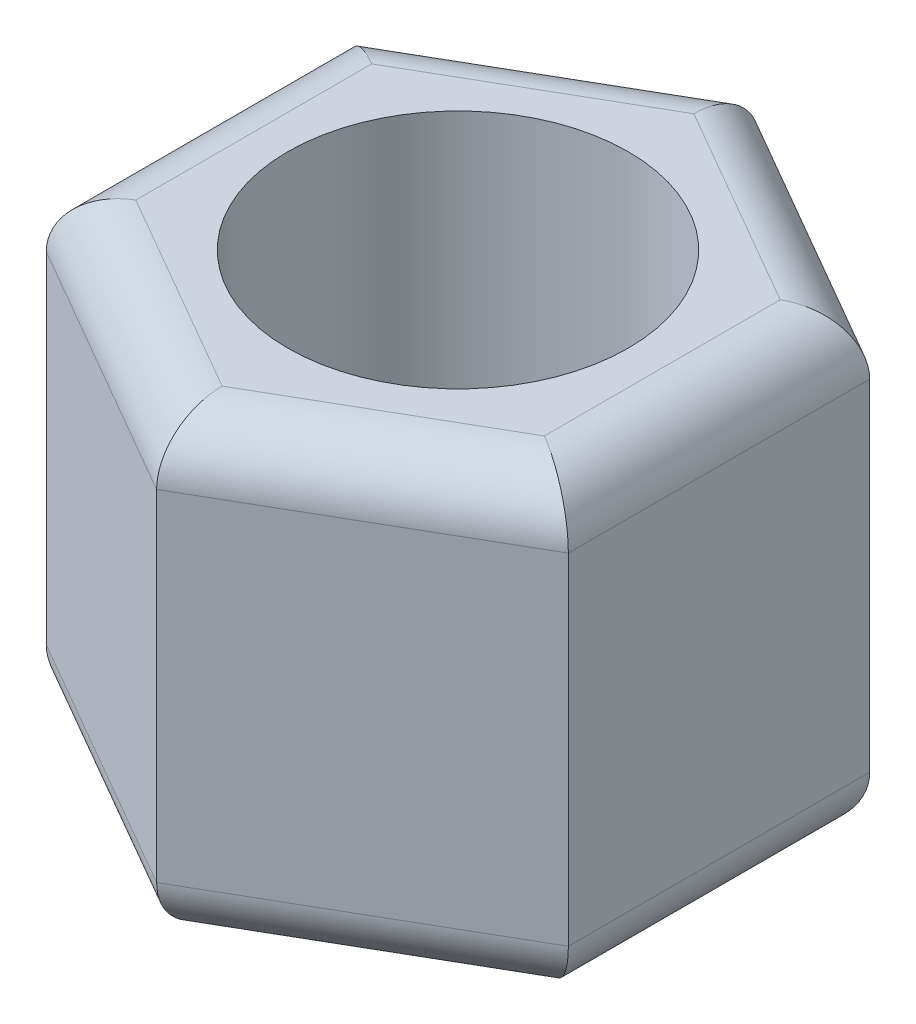
ISO-10303-21;
HEADER;
FILE_DESCRIPTION(('STEP AP214'),'2;1');
FILE_NAME('part.step','',(''),(''),'','','');
FILE_SCHEMA(('AUTOMOTIVE_DESIGN { 1 0 10303 214 1 1 1 1 }'));
ENDSEC;
DATA;
#1=APPLICATION_CONTEXT('core data for automotive mechanical design processes');
#2=APPLICATION_PROTOCOL_DEFINITION('international standard','automotive_design',2000,#1);
#3=PRODUCT_CONTEXT('',#1,'mechanical');
#4=PRODUCT('Part','Part','',(#3));
#5=PRODUCT_RELATED_PRODUCT_CATEGORY('part','',(#4));
#6=PRODUCT_DEFINITION_FORMATION('','',#4);
#7=PRODUCT_DEFINITION_CONTEXT('part definition',#1,'design');
#8=PRODUCT_DEFINITION('design','',#6,#7);
#9=PRODUCT_DEFINITION_SHAPE('','',#8);
#10=(LENGTH_UNIT() NAMED_UNIT(*) SI_UNIT(.MILLI.,.METRE.));
#11=(NAMED_UNIT(*) PLANE_ANGLE_UNIT() SI_UNIT($,.RADIAN.));
#12=(NAMED_UNIT(*) SI_UNIT($,.STERADIAN.) SOLID_ANGLE_UNIT());
#13=UNCERTAINTY_MEASURE_WITH_UNIT(LENGTH_MEASURE(1.E-05),#10,'distance_accuracy_value','');
#14=(GEOMETRIC_REPRESENTATION_CONTEXT(3) GLOBAL_UNCERTAINTY_ASSIGNED_CONTEXT((#13)) GLOBAL_UNIT_ASSIGNED_CONTEXT((#10,
#11,#12)) REPRESENTATION_CONTEXT('',''));
#15=CARTESIAN_POINT('',(0.,0.,0.));
#16=DIRECTION('',(0.,0.,1.));
#17=DIRECTION('',(1.,0.,0.));
#18=AXIS2_PLACEMENT_3D('',#15,#16,#17);
#19=CARTESIAN_POINT('',(0.,4.,0.));
#20=DIRECTION('',(0.,1.,0.));
#21=DIRECTION('',(0.,0.,1.));
#22=AXIS2_PLACEMENT_3D('',#19,#20,#21);
#23=PLANE('',#22);
#24=DIRECTION('',(0.,0.,1.));
#25=VECTOR('',#24,1.);
#26=CARTESIAN_POINT('',(-1.8,4.,1.32790561913614));
#27=LINE('',#26,#25);
#28=CARTESIAN_POINT('',(-1.8,4.,-1.03923048454133));
#29=VERTEX_POINT('',#28);
#30=CARTESIAN_POINT('',(-1.8,4.,1.03923048454133));
#31=VERTEX_POINT('',#30);
#32=EDGE_CURVE('E44',#29,#31,#27,.T.);
#33=ORIENTED_EDGE('',*,*,#32,.T.);
#34=DIRECTION('',(0.866025403784438,0.,0.5));
#35=VECTOR('',#34,1.);
#36=CARTESIAN_POINT('',(0.249999999999999,4.,2.22279853638006));
#37=LINE('',#36,#35);
#38=CARTESIAN_POINT('',(0.,4.,2.07846096908265));
#39=VERTEX_POINT('',#38);
#40=EDGE_CURVE('E11',#31,#39,#37,.T.);
#41=ORIENTED_EDGE('',*,*,#40,.T.);
#42=DIRECTION('',(0.866025403784439,0.,-0.5));
#43=VECTOR('',#42,1.);
#44=CARTESIAN_POINT('',(2.05,4.,0.894892917243921));
#45=LINE('',#44,#43);
#46=CARTESIAN_POINT('',(1.8,4.,1.03923048454133));
#47=VERTEX_POINT('',#46);
#48=EDGE_CURVE('E160',#39,#47,#45,.T.);
#49=ORIENTED_EDGE('',*,*,#48,.T.);
#50=DIRECTION('',(0.,0.,-1.));
#51=VECTOR('',#50,1.);
#52=CARTESIAN_POINT('',(1.8,4.,-1.32790561913614));
#53=LINE('',#52,#51);
#54=CARTESIAN_POINT('',(1.8,4.,-1.03923048454133));
#55=VERTEX_POINT('',#54);
#56=EDGE_CURVE('E257',#47,#55,#53,.T.);
#57=ORIENTED_EDGE('',*,*,#56,.T.);
#58=DIRECTION('',(-0.866025403784439,0.,-0.5));
#59=VECTOR('',#58,1.);
#60=CARTESIAN_POINT('',(-0.25,4.,-2.22279853638006));
#61=LINE('',#60,#59);
#62=CARTESIAN_POINT('',(0.,4.,-2.07846096908265));
#63=VERTEX_POINT('',#62);
#64=EDGE_CURVE('E259',#55,#63,#61,.T.);
#65=ORIENTED_EDGE('',*,*,#64,.T.);
#66=DIRECTION('',(-0.866025403784439,0.,0.5));
#67=VECTOR('',#66,1.);
#68=CARTESIAN_POINT('',(-2.05,4.,-0.894892917243921));
#69=LINE('',#68,#67);
#70=EDGE_CURVE('E55',#63,#29,#69,.T.);
#71=ORIENTED_EDGE('',*,*,#70,.T.);
#72=EDGE_LOOP('',(#33,#41,#49,#57,#65,#71));
#73=FACE_BOUND('',#72,.T.);
#74=CARTESIAN_POINT('',(0.,4.,0.));
#75=DIRECTION('',(0.,1.,0.));
#76=DIRECTION('',(0.,0.,1.));
#77=AXIS2_PLACEMENT_3D('',#74,#75,#76);
#78=CIRCLE('',#77,1.5);
#79=CARTESIAN_POINT('',(0.,4.,1.5));
#80=VERTEX_POINT('',#79);
#81=EDGE_CURVE('E149',#80,#80,#78,.T.);
#82=ORIENTED_EDGE('',*,*,#81,.F.);
#83=EDGE_LOOP('',(#82));
#84=FACE_BOUND('',#83,.T.);
#85=ADVANCED_FACE('F35',(#73,#84),#23,.T.);
#86=CARTESIAN_POINT('',(0.,0.,0.));
#87=DIRECTION('',(0.,1.,0.));
#88=DIRECTION('',(0.,0.,1.));
#89=AXIS2_PLACEMENT_3D('',#86,#87,#88);
#90=PLANE('',#89);
#91=DIRECTION('',(0.866025403784439,0.,-0.5));
#92=VECTOR('',#91,1.);
#93=CARTESIAN_POINT('',(0.899999999999999,0.,1.55884572681199));
#94=LINE('',#93,#92);
#95=CARTESIAN_POINT('',(1.8,0.,1.03923048454133));
#96=VERTEX_POINT('',#95);
#97=CARTESIAN_POINT('',(0.,0.,2.07846096908265));
#98=VERTEX_POINT('',#97);
#99=EDGE_CURVE('E235',#96,#98,#94,.F.);
#100=ORIENTED_EDGE('',*,*,#99,.T.);
#101=DIRECTION('',(0.866025403784438,0.,0.5));
#102=VECTOR('',#101,1.);
#103=CARTESIAN_POINT('',(-0.9,0.,1.55884572681199));
#104=LINE('',#103,#102);
#105=CARTESIAN_POINT('',(-1.8,0.,1.03923048454133));
#106=VERTEX_POINT('',#105);
#107=EDGE_CURVE('E136',#98,#106,#104,.F.);
#108=ORIENTED_EDGE('',*,*,#107,.T.);
#109=DIRECTION('',(0.,0.,1.));
#110=VECTOR('',#109,1.);
#111=CARTESIAN_POINT('',(-1.8,0.,0.));
#112=LINE('',#111,#110);
#113=CARTESIAN_POINT('',(-1.8,0.,-1.03923048454133));
#114=VERTEX_POINT('',#113);
#115=EDGE_CURVE('E227',#106,#114,#112,.F.);
#116=ORIENTED_EDGE('',*,*,#115,.T.);
#117=DIRECTION('',(-0.866025403784439,0.,0.5));
#118=VECTOR('',#117,1.);
#119=CARTESIAN_POINT('',(-0.9,0.,-1.55884572681199));
#120=LINE('',#119,#118);
#121=CARTESIAN_POINT('',(0.,0.,-2.07846096908265));
#122=VERTEX_POINT('',#121);
#123=EDGE_CURVE('E229',#114,#122,#120,.F.);
#124=ORIENTED_EDGE('',*,*,#123,.T.);
#125=DIRECTION('',(-0.866025403784439,0.,-0.5));
#126=VECTOR('',#125,1.);
#127=CARTESIAN_POINT('',(0.9,0.,-1.55884572681199));
#128=LINE('',#127,#126);
#129=CARTESIAN_POINT('',(1.8,0.,-1.03923048454133));
#130=VERTEX_POINT('',#129);
#131=EDGE_CURVE('E231',#122,#130,#128,.F.);
#132=ORIENTED_EDGE('',*,*,#131,.T.);
#133=DIRECTION('',(0.,0.,-1.));
#134=VECTOR('',#133,1.);
#135=CARTESIAN_POINT('',(1.8,0.,0.));
#136=LINE('',#135,#134);
#137=EDGE_CURVE('E233',#130,#96,#136,.F.);
#138=ORIENTED_EDGE('',*,*,#137,.T.);
#139=EDGE_LOOP('',(#100,#108,#116,#124,#132,#138));
#140=FACE_BOUND('',#139,.T.);
#141=CARTESIAN_POINT('',(0.,0.,0.));
#142=DIRECTION('',(0.,1.,0.));
#143=DIRECTION('',(0.,0.,1.));
#144=AXIS2_PLACEMENT_3D('',#141,#142,#143);
#145=CIRCLE('',#144,1.5);
#146=CARTESIAN_POINT('',(0.,0.,1.5));
#147=VERTEX_POINT('',#146);
#148=EDGE_CURVE('E203',#147,#147,#145,.T.);
#149=ORIENTED_EDGE('',*,*,#148,.T.);
#150=EDGE_LOOP('',(#149));
#151=FACE_BOUND('',#150,.T.);
#152=ADVANCED_FACE('F303',(#140,#151),#90,.F.);
#153=CARTESIAN_POINT('',(0.,4.,2.65581123827228));
#154=DIRECTION('',(-0.5,0.,-0.866025403784439));
#155=DIRECTION('',(-0.866025403784439,0.,0.5));
#156=AXIS2_PLACEMENT_3D('',#153,#154,#155);
#157=PLANE('',#156);
#158=DIRECTION('',(0.,-1.,0.));
#159=VECTOR('',#158,1.);
#160=CARTESIAN_POINT('',(0.,4.,2.65581123827228));
#161=LINE('',#160,#159);
#162=CARTESIAN_POINT('',(0.,3.5,2.65581123827228));
#163=VERTEX_POINT('',#162);
#164=CARTESIAN_POINT('',(0.,0.5,2.65581123827228));
#165=VERTEX_POINT('',#164);
#166=EDGE_CURVE('E128',#163,#165,#161,.T.);
#167=ORIENTED_EDGE('',*,*,#166,.T.);
#168=DIRECTION('',(0.866025403784439,0.,-0.5));
#169=VECTOR('',#168,1.);
#170=CARTESIAN_POINT('',(0.,0.5,2.65581123827228));
#171=LINE('',#170,#169);
#172=CARTESIAN_POINT('',(2.3,0.5,1.32790561913614));
#173=VERTEX_POINT('',#172);
#174=EDGE_CURVE('E135',#165,#173,#171,.T.);
#175=ORIENTED_EDGE('',*,*,#174,.T.);
#176=DIRECTION('',(0.,-1.,0.));
#177=VECTOR('',#176,1.);
#178=CARTESIAN_POINT('',(2.3,4.,1.32790561913614));
#179=LINE('',#178,#177);
#180=CARTESIAN_POINT('',(2.3,3.5,1.32790561913614));
#181=VERTEX_POINT('',#180);
#182=EDGE_CURVE('E130',#181,#173,#179,.T.);
#183=ORIENTED_EDGE('',*,*,#182,.F.);
#184=DIRECTION('',(0.866025403784439,0.,-0.5));
#185=VECTOR('',#184,1.);
#186=CARTESIAN_POINT('',(0.,3.5,2.65581123827228));
#187=LINE('',#186,#185);
#188=EDGE_CURVE('E125',#181,#163,#187,.F.);
#189=ORIENTED_EDGE('',*,*,#188,.T.);
#190=EDGE_LOOP('',(#167,#175,#183,#189));
#191=FACE_BOUND('',#190,.T.);
#192=ADVANCED_FACE('F127',(#191),#157,.F.);
#193=CARTESIAN_POINT('',(2.3,4.,1.32790561913614));
#194=DIRECTION('',(-1.,0.,0.));
#195=DIRECTION('',(0.,0.,1.));
#196=AXIS2_PLACEMENT_3D('',#193,#194,#195);
#197=PLANE('',#196);
#198=ORIENTED_EDGE('',*,*,#182,.T.);
#199=DIRECTION('',(0.,0.,-1.));
#200=VECTOR('',#199,1.);
#201=CARTESIAN_POINT('',(2.3,0.5,1.32790561913614));
#202=LINE('',#201,#200);
#203=CARTESIAN_POINT('',(2.3,0.5,-1.32790561913614));
#204=VERTEX_POINT('',#203);
#205=EDGE_CURVE('E242',#173,#204,#202,.T.);
#206=ORIENTED_EDGE('',*,*,#205,.T.);
#207=DIRECTION('',(0.,-1.,0.));
#208=VECTOR('',#207,1.);
#209=CARTESIAN_POINT('',(2.3,4.,-1.32790561913614));
#210=LINE('',#209,#208);
#211=CARTESIAN_POINT('',(2.3,3.5,-1.32790561913614));
#212=VERTEX_POINT('',#211);
#213=EDGE_CURVE('E222',#212,#204,#210,.T.);
#214=ORIENTED_EDGE('',*,*,#213,.F.);
#215=DIRECTION('',(0.,0.,-1.));
#216=VECTOR('',#215,1.);
#217=CARTESIAN_POINT('',(2.3,3.5,1.32790561913614));
#218=LINE('',#217,#216);
#219=EDGE_CURVE('E240',#212,#181,#218,.F.);
#220=ORIENTED_EDGE('',*,*,#219,.T.);
#221=EDGE_LOOP('',(#198,#206,#214,#220));
#222=FACE_BOUND('',#221,.T.);
#223=ADVANCED_FACE('F271',(#222),#197,.F.);
#224=CARTESIAN_POINT('',(2.3,4.,-1.32790561913614));
#225=DIRECTION('',(-0.5,0.,0.866025403784439));
#226=DIRECTION('',(0.866025403784439,0.,0.5));
#227=AXIS2_PLACEMENT_3D('',#224,#225,#226);
#228=PLANE('',#227);
#229=ORIENTED_EDGE('',*,*,#213,.T.);
#230=DIRECTION('',(-0.866025403784439,0.,-0.5));
#231=VECTOR('',#230,1.);
#232=CARTESIAN_POINT('',(2.3,0.5,-1.32790561913614));
#233=LINE('',#232,#231);
#234=CARTESIAN_POINT('',(0.,0.5,-2.65581123827228));
#235=VERTEX_POINT('',#234);
#236=EDGE_CURVE('E246',#204,#235,#233,.T.);
#237=ORIENTED_EDGE('',*,*,#236,.T.);
#238=DIRECTION('',(0.,-1.,0.));
#239=VECTOR('',#238,1.);
#240=CARTESIAN_POINT('',(0.,4.,-2.65581123827228));
#241=LINE('',#240,#239);
#242=CARTESIAN_POINT('',(0.,3.5,-2.65581123827228));
#243=VERTEX_POINT('',#242);
#244=EDGE_CURVE('E219',#243,#235,#241,.T.);
#245=ORIENTED_EDGE('',*,*,#244,.F.);
#246=DIRECTION('',(-0.866025403784439,0.,-0.5));
#247=VECTOR('',#246,1.);
#248=CARTESIAN_POINT('',(2.3,3.5,-1.32790561913614));
#249=LINE('',#248,#247);
#250=EDGE_CURVE('E244',#243,#212,#249,.F.);
#251=ORIENTED_EDGE('',*,*,#250,.T.);
#252=EDGE_LOOP('',(#229,#237,#245,#251));
#253=FACE_BOUND('',#252,.T.);
#254=ADVANCED_FACE('F274',(#253),#228,.F.);
#255=CARTESIAN_POINT('',(0.,4.,-2.65581123827228));
#256=DIRECTION('',(0.5,0.,0.866025403784439));
#257=DIRECTION('',(0.866025403784439,0.,-0.5));
#258=AXIS2_PLACEMENT_3D('',#255,#256,#257);
#259=PLANE('',#258);
#260=ORIENTED_EDGE('',*,*,#244,.T.);
#261=DIRECTION('',(-0.866025403784439,0.,0.5));
#262=VECTOR('',#261,1.);
#263=CARTESIAN_POINT('',(0.,0.5,-2.65581123827228));
#264=LINE('',#263,#262);
#265=CARTESIAN_POINT('',(-2.3,0.5,-1.32790561913614));
#266=VERTEX_POINT('',#265);
#267=EDGE_CURVE('E250',#235,#266,#264,.T.);
#268=ORIENTED_EDGE('',*,*,#267,.T.);
#269=DIRECTION('',(0.,-1.,0.));
#270=VECTOR('',#269,1.);
#271=CARTESIAN_POINT('',(-2.3,4.,-1.32790561913614));
#272=LINE('',#271,#270);
#273=CARTESIAN_POINT('',(-2.3,3.5,-1.32790561913614));
#274=VERTEX_POINT('',#273);
#275=EDGE_CURVE('E216',#274,#266,#272,.T.);
#276=ORIENTED_EDGE('',*,*,#275,.F.);
#277=DIRECTION('',(-0.866025403784439,0.,0.5));
#278=VECTOR('',#277,1.);
#279=CARTESIAN_POINT('',(0.,3.5,-2.65581123827228));
#280=LINE('',#279,#278);
#281=EDGE_CURVE('E248',#274,#243,#280,.F.);
#282=ORIENTED_EDGE('',*,*,#281,.T.);
#283=EDGE_LOOP('',(#260,#268,#276,#282));
#284=FACE_BOUND('',#283,.T.);
#285=ADVANCED_FACE('F284',(#284),#259,.F.);
#286=CARTESIAN_POINT('',(-2.3,4.,-1.32790561913614));
#287=DIRECTION('',(1.,0.,0.));
#288=DIRECTION('',(0.,0.,-1.));
#289=AXIS2_PLACEMENT_3D('',#286,#287,#288);
#290=PLANE('',#289);
#291=ORIENTED_EDGE('',*,*,#275,.T.);
#292=DIRECTION('',(0.,0.,1.));
#293=VECTOR('',#292,1.);
#294=CARTESIAN_POINT('',(-2.3,0.5,-1.32790561913614));
#295=LINE('',#294,#293);
#296=CARTESIAN_POINT('',(-2.3,0.5,1.32790561913614));
#297=VERTEX_POINT('',#296);
#298=EDGE_CURVE('E254',#266,#297,#295,.T.);
#299=ORIENTED_EDGE('',*,*,#298,.T.);
#300=DIRECTION('',(0.,-1.,0.));
#301=VECTOR('',#300,1.);
#302=CARTESIAN_POINT('',(-2.3,4.,1.32790561913614));
#303=LINE('',#302,#301);
#304=CARTESIAN_POINT('',(-2.3,3.5,1.32790561913614));
#305=VERTEX_POINT('',#304);
#306=EDGE_CURVE('E148',#305,#297,#303,.T.);
#307=ORIENTED_EDGE('',*,*,#306,.F.);
#308=DIRECTION('',(0.,0.,1.));
#309=VECTOR('',#308,1.);
#310=CARTESIAN_POINT('',(-2.3,3.5,-1.32790561913614));
#311=LINE('',#310,#309);
#312=EDGE_CURVE('E252',#305,#274,#311,.F.);
#313=ORIENTED_EDGE('',*,*,#312,.T.);
#314=EDGE_LOOP('',(#291,#299,#307,#313));
#315=FACE_BOUND('',#314,.T.);
#316=ADVANCED_FACE('F286',(#315),#290,.F.);
#317=CARTESIAN_POINT('',(-2.3,4.,1.32790561913614));
#318=DIRECTION('',(0.5,0.,-0.866025403784439));
#319=DIRECTION('',(-0.866025403784438,0.,-0.5));
#320=AXIS2_PLACEMENT_3D('',#317,#318,#319);
#321=PLANE('',#320);
#322=ORIENTED_EDGE('',*,*,#306,.T.);
#323=DIRECTION('',(0.866025403784438,0.,0.5));
#324=VECTOR('',#323,1.);
#325=CARTESIAN_POINT('',(-2.3,0.5,1.32790561913614));
#326=LINE('',#325,#324);
#327=EDGE_CURVE('E147',#297,#165,#326,.T.);
#328=ORIENTED_EDGE('',*,*,#327,.T.);
#329=ORIENTED_EDGE('',*,*,#166,.F.);
#330=DIRECTION('',(0.866025403784438,0.,0.5));
#331=VECTOR('',#330,1.);
#332=CARTESIAN_POINT('',(-2.3,3.5,1.32790561913614));
#333=LINE('',#332,#331);
#334=EDGE_CURVE('E144',#163,#305,#333,.F.);
#335=ORIENTED_EDGE('',*,*,#334,.T.);
#336=EDGE_LOOP('',(#322,#328,#329,#335));
#337=FACE_BOUND('',#336,.T.);
#338=ADVANCED_FACE('F143',(#337),#321,.F.);
#339=CARTESIAN_POINT('',(0.,4.,0.));
#340=DIRECTION('',(0.,-1.,0.));
#341=DIRECTION('',(0.,0.,-1.));
#342=AXIS2_PLACEMENT_3D('',#339,#340,#341);
#343=CYLINDRICAL_SURFACE('',#342,1.5);
#344=ORIENTED_EDGE('',*,*,#81,.T.);
#345=EDGE_LOOP('',(#344));
#346=FACE_BOUND('',#345,.T.);
#347=ORIENTED_EDGE('',*,*,#148,.F.);
#348=EDGE_LOOP('',(#347));
#349=FACE_BOUND('',#348,.T.);
#350=ADVANCED_FACE('F311',(#346,#349),#343,.F.);
#351=CARTESIAN_POINT('',(2.05,0.5,-0.894892917243921));
#352=DIRECTION('',(-0.866025403784439,0.,-0.5));
#353=DIRECTION('',(-0.5,0.,0.866025403784439));
#354=AXIS2_PLACEMENT_3D('',#351,#352,#353);
#355=CYLINDRICAL_SURFACE('',#354,0.5);
#356=CARTESIAN_POINT('',(1.8,0.5,-1.03923048454133));
#357=DIRECTION('',(-0.5,0.,-0.866025403784439));
#358=DIRECTION('',(-0.866025403784439,0.,0.5));
#359=AXIS2_PLACEMENT_3D('',#356,#357,#358);
#360=ELLIPSE('',#359,0.577350269189626,0.5);
#361=EDGE_CURVE('E196',#130,#204,#360,.F.);
#362=ORIENTED_EDGE('',*,*,#361,.F.);
#363=ORIENTED_EDGE('',*,*,#131,.F.);
#364=CARTESIAN_POINT('',(0.,0.5,-2.07846096908265));
#365=DIRECTION('',(-1.,0.,0.));
#366=DIRECTION('',(0.,0.,1.));
#367=AXIS2_PLACEMENT_3D('',#364,#365,#366);
#368=ELLIPSE('',#367,0.577350269189626,0.5);
#369=EDGE_CURVE('E165',#235,#122,#368,.T.);
#370=ORIENTED_EDGE('',*,*,#369,.F.);
#371=ORIENTED_EDGE('',*,*,#236,.F.);
#372=EDGE_LOOP('',(#362,#363,#370,#371));
#373=FACE_BOUND('',#372,.T.);
#374=ADVANCED_FACE('F277',(#373),#355,.T.);
#375=CARTESIAN_POINT('',(0.25,0.5,-2.22279853638006));
#376=DIRECTION('',(-0.866025403784439,0.,0.5));
#377=DIRECTION('',(0.5,0.,0.866025403784439));
#378=AXIS2_PLACEMENT_3D('',#375,#376,#377);
#379=CYLINDRICAL_SURFACE('',#378,0.5);
#380=ORIENTED_EDGE('',*,*,#369,.T.);
#381=ORIENTED_EDGE('',*,*,#123,.F.);
#382=CARTESIAN_POINT('',(-1.8,0.5,-1.03923048454133));
#383=DIRECTION('',(-0.5,0.,0.866025403784439));
#384=DIRECTION('',(0.866025403784439,0.,0.5));
#385=AXIS2_PLACEMENT_3D('',#382,#383,#384);
#386=ELLIPSE('',#385,0.577350269189626,0.5);
#387=EDGE_CURVE('E194',#266,#114,#386,.T.);
#388=ORIENTED_EDGE('',*,*,#387,.F.);
#389=ORIENTED_EDGE('',*,*,#267,.F.);
#390=EDGE_LOOP('',(#380,#381,#388,#389));
#391=FACE_BOUND('',#390,.T.);
#392=ADVANCED_FACE('F280',(#391),#379,.T.);
#393=CARTESIAN_POINT('',(1.8,0.5,1.32790561913614));
#394=DIRECTION('',(0.,0.,-1.));
#395=DIRECTION('',(-1.,0.,0.));
#396=AXIS2_PLACEMENT_3D('',#393,#394,#395);
#397=CYLINDRICAL_SURFACE('',#396,0.5);
#398=ORIENTED_EDGE('',*,*,#361,.T.);
#399=ORIENTED_EDGE('',*,*,#205,.F.);
#400=CARTESIAN_POINT('',(1.8,0.5,1.03923048454133));
#401=DIRECTION('',(0.5,0.,-0.866025403784439));
#402=DIRECTION('',(-0.866025403784439,0.,-0.5));
#403=AXIS2_PLACEMENT_3D('',#400,#401,#402);
#404=ELLIPSE('',#403,0.577350269189626,0.5);
#405=EDGE_CURVE('E188',#96,#173,#404,.F.);
#406=ORIENTED_EDGE('',*,*,#405,.F.);
#407=ORIENTED_EDGE('',*,*,#137,.F.);
#408=EDGE_LOOP('',(#398,#399,#406,#407));
#409=FACE_BOUND('',#408,.T.);
#410=ADVANCED_FACE('F365',(#409),#397,.T.);
#411=CARTESIAN_POINT('',(-1.8,0.5,-1.32790561913614));
#412=DIRECTION('',(0.,0.,1.));
#413=DIRECTION('',(1.,0.,0.));
#414=AXIS2_PLACEMENT_3D('',#411,#412,#413);
#415=CYLINDRICAL_SURFACE('',#414,0.5);
#416=ORIENTED_EDGE('',*,*,#387,.T.);
#417=ORIENTED_EDGE('',*,*,#115,.F.);
#418=CARTESIAN_POINT('',(-1.8,0.5,1.03923048454133));
#419=DIRECTION('',(0.5,0.,0.866025403784439));
#420=DIRECTION('',(-0.866025403784439,0.,0.5));
#421=AXIS2_PLACEMENT_3D('',#418,#419,#420);
#422=ELLIPSE('',#421,0.577350269189626,0.5);
#423=EDGE_CURVE('E182',#297,#106,#422,.T.);
#424=ORIENTED_EDGE('',*,*,#423,.F.);
#425=ORIENTED_EDGE('',*,*,#298,.F.);
#426=EDGE_LOOP('',(#416,#417,#424,#425));
#427=FACE_BOUND('',#426,.T.);
#428=ADVANCED_FACE('F290',(#427),#415,.T.);
#429=CARTESIAN_POINT('',(-0.250000000000001,0.5,2.22279853638006));
#430=DIRECTION('',(0.866025403784439,0.,-0.5));
#431=DIRECTION('',(-0.5,0.,-0.866025403784439));
#432=AXIS2_PLACEMENT_3D('',#429,#430,#431);
#433=CYLINDRICAL_SURFACE('',#432,0.5);
#434=ORIENTED_EDGE('',*,*,#405,.T.);
#435=ORIENTED_EDGE('',*,*,#174,.F.);
#436=CARTESIAN_POINT('',(0.,0.5,2.07846096908265));
#437=DIRECTION('',(1.,0.,0.));
#438=DIRECTION('',(0.,0.,-1.));
#439=AXIS2_PLACEMENT_3D('',#436,#437,#438);
#440=ELLIPSE('',#439,0.577350269189626,0.5);
#441=EDGE_CURVE('E178',#98,#165,#440,.F.);
#442=ORIENTED_EDGE('',*,*,#441,.F.);
#443=ORIENTED_EDGE('',*,*,#99,.F.);
#444=EDGE_LOOP('',(#434,#435,#442,#443));
#445=FACE_BOUND('',#444,.T.);
#446=ADVANCED_FACE('F293',(#445),#433,.T.);
#447=CARTESIAN_POINT('',(-2.05,0.5,0.89489291724392));
#448=DIRECTION('',(0.866025403784438,0.,0.5));
#449=DIRECTION('',(0.5,0.,-0.866025403784439));
#450=AXIS2_PLACEMENT_3D('',#447,#448,#449);
#451=CYLINDRICAL_SURFACE('',#450,0.5);
#452=ORIENTED_EDGE('',*,*,#423,.T.);
#453=ORIENTED_EDGE('',*,*,#107,.F.);
#454=ORIENTED_EDGE('',*,*,#441,.T.);
#455=ORIENTED_EDGE('',*,*,#327,.F.);
#456=EDGE_LOOP('',(#452,#453,#454,#455));
#457=FACE_BOUND('',#456,.T.);
#458=ADVANCED_FACE('F291',(#457),#451,.T.);
#459=CARTESIAN_POINT('',(0.9,3.5,-1.55884572681199));
#460=DIRECTION('',(0.866025403784439,0.,0.5));
#461=DIRECTION('',(0.5,0.,-0.866025403784439));
#462=AXIS2_PLACEMENT_3D('',#459,#460,#461);
#463=CYLINDRICAL_SURFACE('',#462,0.5);
#464=CARTESIAN_POINT('',(1.8,3.5,-1.03923048454133));
#465=DIRECTION('',(0.5,0.,0.866025403784439));
#466=DIRECTION('',(-0.866025403784439,0.,0.5));
#467=AXIS2_PLACEMENT_3D('',#464,#465,#466);
#468=ELLIPSE('',#467,0.577350269189626,0.5);
#469=EDGE_CURVE('E171',#212,#55,#468,.T.);
#470=ORIENTED_EDGE('',*,*,#469,.F.);
#471=ORIENTED_EDGE('',*,*,#250,.F.);
#472=CARTESIAN_POINT('',(0.,3.5,-2.07846096908265));
#473=DIRECTION('',(1.,0.,0.));
#474=DIRECTION('',(0.,0.,1.));
#475=AXIS2_PLACEMENT_3D('',#472,#473,#474);
#476=ELLIPSE('',#475,0.577350269189626,0.5);
#477=EDGE_CURVE('E39',#63,#243,#476,.F.);
#478=ORIENTED_EDGE('',*,*,#477,.F.);
#479=ORIENTED_EDGE('',*,*,#64,.F.);
#480=EDGE_LOOP('',(#470,#471,#478,#479));
#481=FACE_BOUND('',#480,.T.);
#482=ADVANCED_FACE('F37',(#481),#463,.T.);
#483=CARTESIAN_POINT('',(-0.9,3.5,-1.55884572681199));
#484=DIRECTION('',(0.866025403784439,0.,-0.5));
#485=DIRECTION('',(-0.5,0.,-0.866025403784439));
#486=AXIS2_PLACEMENT_3D('',#483,#484,#485);
#487=CYLINDRICAL_SURFACE('',#486,0.5);
#488=ORIENTED_EDGE('',*,*,#477,.T.);
#489=ORIENTED_EDGE('',*,*,#281,.F.);
#490=CARTESIAN_POINT('',(-1.8,3.5,-1.03923048454133));
#491=DIRECTION('',(0.5,0.,-0.866025403784439));
#492=DIRECTION('',(0.866025403784439,0.,0.5));
#493=AXIS2_PLACEMENT_3D('',#490,#491,#492);
#494=ELLIPSE('',#493,0.577350269189626,0.5);
#495=EDGE_CURVE('E169',#29,#274,#494,.F.);
#496=ORIENTED_EDGE('',*,*,#495,.F.);
#497=ORIENTED_EDGE('',*,*,#70,.F.);
#498=EDGE_LOOP('',(#488,#489,#496,#497));
#499=FACE_BOUND('',#498,.T.);
#500=ADVANCED_FACE('F265',(#499),#487,.T.);
#501=CARTESIAN_POINT('',(1.8,3.5,0.));
#502=DIRECTION('',(0.,0.,1.));
#503=DIRECTION('',(1.,0.,0.));
#504=AXIS2_PLACEMENT_3D('',#501,#502,#503);
#505=CYLINDRICAL_SURFACE('',#504,0.5);
#506=ORIENTED_EDGE('',*,*,#469,.T.);
#507=ORIENTED_EDGE('',*,*,#56,.F.);
#508=CARTESIAN_POINT('',(1.8,3.5,1.03923048454133));
#509=DIRECTION('',(-0.5,0.,0.866025403784439));
#510=DIRECTION('',(-0.866025403784439,0.,-0.5));
#511=AXIS2_PLACEMENT_3D('',#508,#509,#510);
#512=ELLIPSE('',#511,0.577350269189626,0.5);
#513=EDGE_CURVE('E162',#181,#47,#512,.T.);
#514=ORIENTED_EDGE('',*,*,#513,.F.);
#515=ORIENTED_EDGE('',*,*,#219,.F.);
#516=EDGE_LOOP('',(#506,#507,#514,#515));
#517=FACE_BOUND('',#516,.T.);
#518=ADVANCED_FACE('F268',(#517),#505,.T.);
#519=CARTESIAN_POINT('',(-1.8,3.5,0.));
#520=DIRECTION('',(0.,0.,-1.));
#521=DIRECTION('',(-1.,0.,0.));
#522=AXIS2_PLACEMENT_3D('',#519,#520,#521);
#523=CYLINDRICAL_SURFACE('',#522,0.5);
#524=ORIENTED_EDGE('',*,*,#495,.T.);
#525=ORIENTED_EDGE('',*,*,#312,.F.);
#526=CARTESIAN_POINT('',(-1.8,3.5,1.03923048454133));
#527=DIRECTION('',(-0.5,0.,-0.866025403784439));
#528=DIRECTION('',(0.866025403784439,0.,-0.5));
#529=AXIS2_PLACEMENT_3D('',#526,#527,#528);
#530=ELLIPSE('',#529,0.577350269189626,0.5);
#531=EDGE_CURVE('E156',#31,#305,#530,.F.);
#532=ORIENTED_EDGE('',*,*,#531,.F.);
#533=ORIENTED_EDGE('',*,*,#32,.F.);
#534=EDGE_LOOP('',(#524,#525,#532,#533));
#535=FACE_BOUND('',#534,.T.);
#536=ADVANCED_FACE('F267',(#535),#523,.T.);
#537=CARTESIAN_POINT('',(0.899999999999999,3.5,1.55884572681199));
#538=DIRECTION('',(-0.866025403784439,0.,0.5));
#539=DIRECTION('',(0.5,0.,0.866025403784439));
#540=AXIS2_PLACEMENT_3D('',#537,#538,#539);
#541=CYLINDRICAL_SURFACE('',#540,0.5);
#542=ORIENTED_EDGE('',*,*,#513,.T.);
#543=ORIENTED_EDGE('',*,*,#48,.F.);
#544=CARTESIAN_POINT('',(0.,3.5,2.07846096908265));
#545=DIRECTION('',(-1.,0.,0.));
#546=DIRECTION('',(0.,0.,1.));
#547=AXIS2_PLACEMENT_3D('',#544,#545,#546);
#548=ELLIPSE('',#547,0.577350269189626,0.5);
#549=EDGE_CURVE('E154',#163,#39,#548,.T.);
#550=ORIENTED_EDGE('',*,*,#549,.F.);
#551=ORIENTED_EDGE('',*,*,#188,.F.);
#552=EDGE_LOOP('',(#542,#543,#550,#551));
#553=FACE_BOUND('',#552,.T.);
#554=ADVANCED_FACE('F159',(#553),#541,.T.);
#555=CARTESIAN_POINT('',(-0.9,3.5,1.55884572681199));
#556=DIRECTION('',(-0.866025403784438,0.,-0.5));
#557=DIRECTION('',(-0.5,0.,0.866025403784439));
#558=AXIS2_PLACEMENT_3D('',#555,#556,#557);
#559=CYLINDRICAL_SURFACE('',#558,0.5);
#560=ORIENTED_EDGE('',*,*,#531,.T.);
#561=ORIENTED_EDGE('',*,*,#334,.F.);
#562=ORIENTED_EDGE('',*,*,#549,.T.);
#563=ORIENTED_EDGE('',*,*,#40,.F.);
#564=EDGE_LOOP('',(#560,#561,#562,#563));
#565=FACE_BOUND('',#564,.T.);
#566=ADVANCED_FACE('F152',(#565),#559,.T.);
#567=CLOSED_SHELL('',(#85,#152,#192,#223,#254,#285,#316,#338,#350,#374,#392,#410,#428,#446,#458,
#482,#500,#518,#536,#554,#566));
#568=MANIFOLD_SOLID_BREP('B2',#567);
#569=ADVANCED_BREP_SHAPE_REPRESENTATION('',(#18,#568),#14);
#570=SHAPE_DEFINITION_REPRESENTATION(#9,#569);
ENDSEC;
END-ISO-10303-21;
